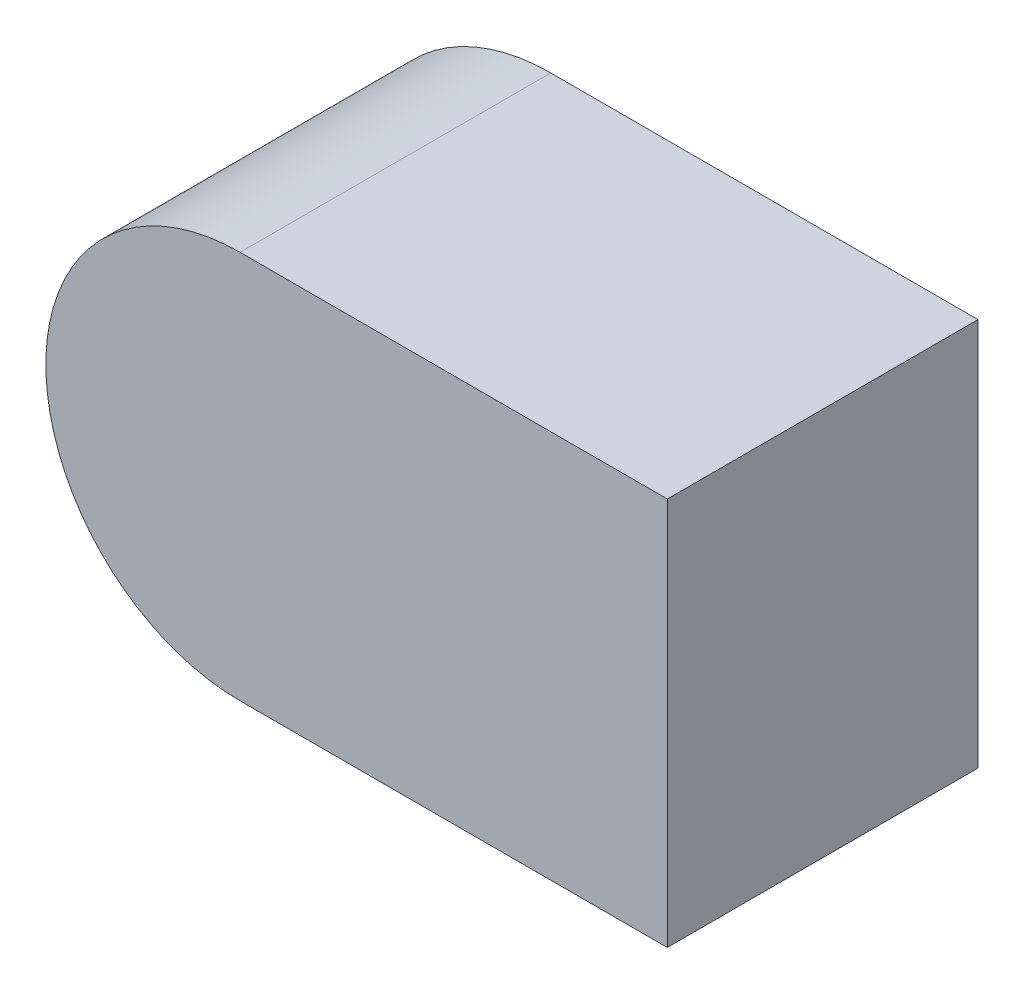
ISO-10303-21;
HEADER;
FILE_DESCRIPTION(('STEP AP214'),'2;1');
FILE_NAME('part.step','',(''),(''),'','','');
FILE_SCHEMA(('AUTOMOTIVE_DESIGN { 1 0 10303 214 1 1 1 1 }'));
ENDSEC;
DATA;
#1=APPLICATION_CONTEXT('core data for automotive mechanical design processes');
#2=APPLICATION_PROTOCOL_DEFINITION('international standard','automotive_design',2000,#1);
#3=PRODUCT_CONTEXT('',#1,'mechanical');
#4=PRODUCT('Part','Part','',(#3));
#5=PRODUCT_RELATED_PRODUCT_CATEGORY('part','',(#4));
#6=PRODUCT_DEFINITION_FORMATION('','',#4);
#7=PRODUCT_DEFINITION_CONTEXT('part definition',#1,'design');
#8=PRODUCT_DEFINITION('design','',#6,#7);
#9=PRODUCT_DEFINITION_SHAPE('','',#8);
#10=(LENGTH_UNIT() NAMED_UNIT(*) SI_UNIT(.MILLI.,.METRE.));
#11=(NAMED_UNIT(*) PLANE_ANGLE_UNIT() SI_UNIT($,.RADIAN.));
#12=(NAMED_UNIT(*) SI_UNIT($,.STERADIAN.) SOLID_ANGLE_UNIT());
#13=UNCERTAINTY_MEASURE_WITH_UNIT(LENGTH_MEASURE(1.E-05),#10,'distance_accuracy_value','');
#14=(GEOMETRIC_REPRESENTATION_CONTEXT(3) GLOBAL_UNCERTAINTY_ASSIGNED_CONTEXT((#13)) GLOBAL_UNIT_ASSIGNED_CONTEXT((#10,
#11,#12)) REPRESENTATION_CONTEXT('',''));
#15=CARTESIAN_POINT('',(0.,0.,0.));
#16=DIRECTION('',(0.,0.,1.));
#17=DIRECTION('',(1.,0.,0.));
#18=AXIS2_PLACEMENT_3D('',#15,#16,#17);
#19=CARTESIAN_POINT('',(1.5,-0.625,0.));
#20=DIRECTION('',(1.,0.,0.));
#21=DIRECTION('',(0.,1.,0.));
#22=AXIS2_PLACEMENT_3D('',#19,#20,#21);
#23=PLANE('',#22);
#24=DIRECTION('',(0.,1.,0.));
#25=VECTOR('',#24,1.);
#26=CARTESIAN_POINT('',(1.5,-0.625,0.));
#27=LINE('',#26,#25);
#28=CARTESIAN_POINT('',(1.5,-0.625,0.));
#29=VERTEX_POINT('',#28);
#30=CARTESIAN_POINT('',(1.5,-0.375,0.));
#31=VERTEX_POINT('',#30);
#32=EDGE_CURVE('E11',#29,#31,#27,.T.);
#33=ORIENTED_EDGE('',*,*,#32,.T.);
#34=DIRECTION('',(0.,0.,1.));
#35=VECTOR('',#34,1.);
#36=CARTESIAN_POINT('',(1.5,-0.375,0.));
#37=LINE('',#36,#35);
#38=CARTESIAN_POINT('',(1.5,-0.375,0.2));
#39=VERTEX_POINT('',#38);
#40=EDGE_CURVE('E24',#31,#39,#37,.T.);
#41=ORIENTED_EDGE('',*,*,#40,.T.);
#42=DIRECTION('',(0.,1.,0.));
#43=VECTOR('',#42,1.);
#44=CARTESIAN_POINT('',(1.5,-0.625,0.2));
#45=LINE('',#44,#43);
#46=CARTESIAN_POINT('',(1.5,-0.625,0.2));
#47=VERTEX_POINT('',#46);
#48=EDGE_CURVE('E75',#47,#39,#45,.T.);
#49=ORIENTED_EDGE('',*,*,#48,.F.);
#50=DIRECTION('',(0.,0.,1.));
#51=VECTOR('',#50,1.);
#52=CARTESIAN_POINT('',(1.5,-0.625,0.));
#53=LINE('',#52,#51);
#54=EDGE_CURVE('E86',#29,#47,#53,.T.);
#55=ORIENTED_EDGE('',*,*,#54,.F.);
#56=EDGE_LOOP('',(#33,#41,#49,#55));
#57=FACE_BOUND('',#56,.T.);
#58=ADVANCED_FACE('F17',(#57),#23,.T.);
#59=CARTESIAN_POINT('',(1.225,-0.625,0.));
#60=DIRECTION('',(0.,-1.,0.));
#61=DIRECTION('',(1.,0.,0.));
#62=AXIS2_PLACEMENT_3D('',#59,#60,#61);
#63=PLANE('',#62);
#64=DIRECTION('',(1.,0.,0.));
#65=VECTOR('',#64,1.);
#66=CARTESIAN_POINT('',(1.225,-0.625,0.));
#67=LINE('',#66,#65);
#68=CARTESIAN_POINT('',(1.225,-0.625,0.));
#69=VERTEX_POINT('',#68);
#70=EDGE_CURVE('E83',#69,#29,#67,.T.);
#71=ORIENTED_EDGE('',*,*,#70,.T.);
#72=ORIENTED_EDGE('',*,*,#54,.T.);
#73=DIRECTION('',(1.,0.,0.));
#74=VECTOR('',#73,1.);
#75=CARTESIAN_POINT('',(1.225,-0.625,0.2));
#76=LINE('',#75,#74);
#77=CARTESIAN_POINT('',(1.225,-0.625,0.2));
#78=VERTEX_POINT('',#77);
#79=EDGE_CURVE('E81',#78,#47,#76,.T.);
#80=ORIENTED_EDGE('',*,*,#79,.F.);
#81=DIRECTION('',(0.,0.,1.));
#82=VECTOR('',#81,1.);
#83=CARTESIAN_POINT('',(1.225,-0.625,0.));
#84=LINE('',#83,#82);
#85=EDGE_CURVE('E61',#69,#78,#84,.T.);
#86=ORIENTED_EDGE('',*,*,#85,.F.);
#87=EDGE_LOOP('',(#71,#72,#80,#86));
#88=FACE_BOUND('',#87,.T.);
#89=ADVANCED_FACE('F91',(#88),#63,.T.);
#90=CARTESIAN_POINT('',(1.225,-0.5,0.));
#91=DIRECTION('',(0.,0.,1.));
#92=DIRECTION('',(0.,1.,0.));
#93=AXIS2_PLACEMENT_3D('',#90,#91,#92);
#94=CYLINDRICAL_SURFACE('',#93,0.125);
#95=CARTESIAN_POINT('',(1.225,-0.5,0.));
#96=DIRECTION('',(0.,0.,1.));
#97=DIRECTION('',(0.,1.,0.));
#98=AXIS2_PLACEMENT_3D('',#95,#96,#97);
#99=CIRCLE('',#98,0.125);
#100=CARTESIAN_POINT('',(1.225,-0.375,0.));
#101=VERTEX_POINT('',#100);
#102=EDGE_CURVE('E65',#101,#69,#99,.T.);
#103=ORIENTED_EDGE('',*,*,#102,.T.);
#104=ORIENTED_EDGE('',*,*,#85,.T.);
#105=CARTESIAN_POINT('',(1.225,-0.5,0.2));
#106=DIRECTION('',(0.,0.,1.));
#107=DIRECTION('',(0.,1.,0.));
#108=AXIS2_PLACEMENT_3D('',#105,#106,#107);
#109=CIRCLE('',#108,0.125);
#110=CARTESIAN_POINT('',(1.225,-0.375,0.2));
#111=VERTEX_POINT('',#110);
#112=EDGE_CURVE('E54',#111,#78,#109,.T.);
#113=ORIENTED_EDGE('',*,*,#112,.F.);
#114=DIRECTION('',(0.,0.,1.));
#115=VECTOR('',#114,1.);
#116=CARTESIAN_POINT('',(1.225,-0.375,0.));
#117=LINE('',#116,#115);
#118=EDGE_CURVE('E58',#101,#111,#117,.T.);
#119=ORIENTED_EDGE('',*,*,#118,.F.);
#120=EDGE_LOOP('',(#103,#104,#113,#119));
#121=FACE_BOUND('',#120,.T.);
#122=ADVANCED_FACE('F57',(#121),#94,.T.);
#123=CARTESIAN_POINT('',(1.5,-0.375,0.));
#124=DIRECTION('',(0.,1.,0.));
#125=DIRECTION('',(-1.,0.,0.));
#126=AXIS2_PLACEMENT_3D('',#123,#124,#125);
#127=PLANE('',#126);
#128=DIRECTION('',(-1.,0.,0.));
#129=VECTOR('',#128,1.);
#130=CARTESIAN_POINT('',(1.5,-0.375,0.));
#131=LINE('',#130,#129);
#132=EDGE_CURVE('E71',#31,#101,#131,.T.);
#133=ORIENTED_EDGE('',*,*,#132,.T.);
#134=ORIENTED_EDGE('',*,*,#118,.T.);
#135=DIRECTION('',(-1.,0.,0.));
#136=VECTOR('',#135,1.);
#137=CARTESIAN_POINT('',(1.5,-0.375,0.2));
#138=LINE('',#137,#136);
#139=EDGE_CURVE('E70',#39,#111,#138,.T.);
#140=ORIENTED_EDGE('',*,*,#139,.F.);
#141=ORIENTED_EDGE('',*,*,#40,.F.);
#142=EDGE_LOOP('',(#133,#134,#140,#141));
#143=FACE_BOUND('',#142,.T.);
#144=ADVANCED_FACE('F69',(#143),#127,.T.);
#145=CARTESIAN_POINT('',(1.3,-0.5,0.2));
#146=DIRECTION('',(0.,0.,1.));
#147=DIRECTION('',(1.,0.,0.));
#148=AXIS2_PLACEMENT_3D('',#145,#146,#147);
#149=PLANE('',#148);
#150=ORIENTED_EDGE('',*,*,#139,.T.);
#151=ORIENTED_EDGE('',*,*,#112,.T.);
#152=ORIENTED_EDGE('',*,*,#79,.T.);
#153=ORIENTED_EDGE('',*,*,#48,.T.);
#154=EDGE_LOOP('',(#150,#151,#152,#153));
#155=FACE_BOUND('',#154,.T.);
#156=ADVANCED_FACE('F74',(#155),#149,.T.);
#157=CARTESIAN_POINT('',(1.3,-0.5,0.));
#158=DIRECTION('',(0.,0.,1.));
#159=DIRECTION('',(1.,0.,0.));
#160=AXIS2_PLACEMENT_3D('',#157,#158,#159);
#161=PLANE('',#160);
#162=ORIENTED_EDGE('',*,*,#132,.F.);
#163=ORIENTED_EDGE('',*,*,#32,.F.);
#164=ORIENTED_EDGE('',*,*,#70,.F.);
#165=ORIENTED_EDGE('',*,*,#102,.F.);
#166=EDGE_LOOP('',(#162,#163,#164,#165));
#167=FACE_BOUND('',#166,.T.);
#168=ADVANCED_FACE('F89',(#167),#161,.F.);
#169=CLOSED_SHELL('',(#58,#89,#122,#144,#156,#168));
#170=MANIFOLD_SOLID_BREP('B1',#169);
#171=ADVANCED_BREP_SHAPE_REPRESENTATION('',(#18,#170),#14);
#172=SHAPE_DEFINITION_REPRESENTATION(#9,#171);
ENDSEC;
END-ISO-10303-21;
